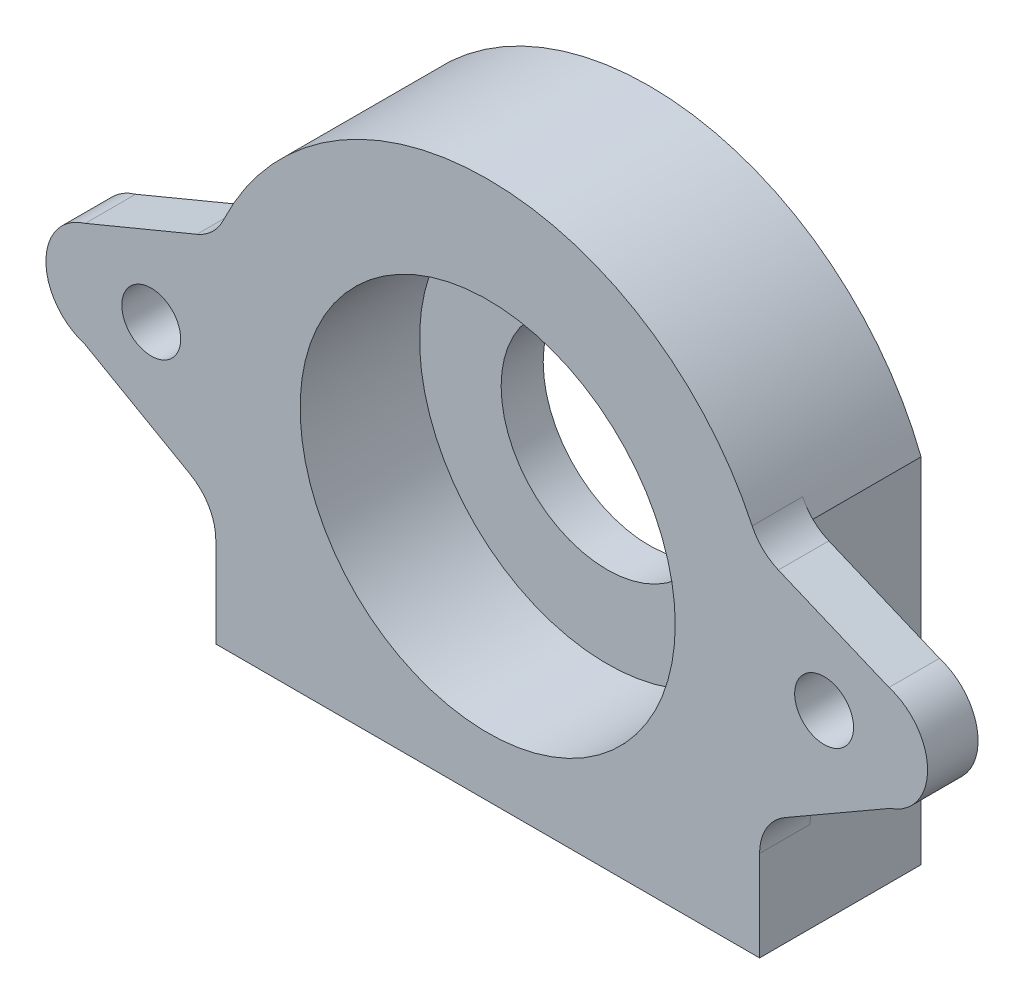
ISO-10303-21;
HEADER;
FILE_DESCRIPTION(('STEP AP214'),'2;1');
FILE_NAME('part.step','',(''),(''),'','','');
FILE_SCHEMA(('AUTOMOTIVE_DESIGN { 1 0 10303 214 1 1 1 1 }'));
ENDSEC;
DATA;
#1=APPLICATION_CONTEXT('core data for automotive mechanical design processes');
#2=APPLICATION_PROTOCOL_DEFINITION('international standard','automotive_design',2000,#1);
#3=PRODUCT_CONTEXT('',#1,'mechanical');
#4=PRODUCT('Part','Part','',(#3));
#5=PRODUCT_RELATED_PRODUCT_CATEGORY('part','',(#4));
#6=PRODUCT_DEFINITION_FORMATION('','',#4);
#7=PRODUCT_DEFINITION_CONTEXT('part definition',#1,'design');
#8=PRODUCT_DEFINITION('design','',#6,#7);
#9=PRODUCT_DEFINITION_SHAPE('','',#8);
#10=(LENGTH_UNIT() NAMED_UNIT(*) SI_UNIT(.MILLI.,.METRE.));
#11=(NAMED_UNIT(*) PLANE_ANGLE_UNIT() SI_UNIT($,.RADIAN.));
#12=(NAMED_UNIT(*) SI_UNIT($,.STERADIAN.) SOLID_ANGLE_UNIT());
#13=UNCERTAINTY_MEASURE_WITH_UNIT(LENGTH_MEASURE(1.E-05),#10,'distance_accuracy_value','');
#14=(GEOMETRIC_REPRESENTATION_CONTEXT(3) GLOBAL_UNCERTAINTY_ASSIGNED_CONTEXT((#13)) GLOBAL_UNIT_ASSIGNED_CONTEXT((#10,
#11,#12)) REPRESENTATION_CONTEXT('',''));
#15=CARTESIAN_POINT('',(0.,0.,0.));
#16=DIRECTION('',(0.,0.,1.));
#17=DIRECTION('',(1.,0.,0.));
#18=AXIS2_PLACEMENT_3D('',#15,#16,#17);
#19=CARTESIAN_POINT('',(0.,0.,2.5));
#20=DIRECTION('',(0.,0.,1.));
#21=DIRECTION('',(1.,0.,0.));
#22=AXIS2_PLACEMENT_3D('',#19,#20,#21);
#23=PLANE('',#22);
#24=CARTESIAN_POINT('',(0.,0.,2.5));
#25=DIRECTION('',(0.,0.,1.));
#26=DIRECTION('',(1.,0.,0.));
#27=AXIS2_PLACEMENT_3D('',#24,#25,#26);
#28=CIRCLE('',#27,6.30000000000002);
#29=CARTESIAN_POINT('',(6.29999999999994,0.,2.5));
#30=VERTEX_POINT('',#29);
#31=EDGE_CURVE('E196',#30,#30,#28,.F.);
#32=ORIENTED_EDGE('',*,*,#31,.T.);
#33=EDGE_LOOP('',(#32));
#34=FACE_BOUND('',#33,.T.);
#35=CARTESIAN_POINT('',(0.,0.,2.5));
#36=DIRECTION('',(0.,0.,1.));
#37=DIRECTION('',(1.,0.,0.));
#38=AXIS2_PLACEMENT_3D('',#35,#36,#37);
#39=CIRCLE('',#38,11.15);
#40=CARTESIAN_POINT('',(11.15,0.,2.5));
#41=VERTEX_POINT('',#40);
#42=EDGE_CURVE('E11',#41,#41,#39,.F.);
#43=ORIENTED_EDGE('',*,*,#42,.F.);
#44=EDGE_LOOP('',(#43));
#45=FACE_BOUND('',#44,.T.);
#46=ADVANCED_FACE('F41',(#34,#45),#23,.T.);
#47=CARTESIAN_POINT('',(-16.1638504935599,6.34296785302776,2.5));
#48=DIRECTION('',(1.,0.,0.));
#49=DIRECTION('',(0.,0.,-1.));
#50=AXIS2_PLACEMENT_3D('',#47,#48,#49);
#51=PLANE('',#50);
#52=DIRECTION('',(0.,-1.,0.));
#53=VECTOR('',#52,1.);
#54=CARTESIAN_POINT('',(-16.1638504935599,6.34296785302776,0.));
#55=LINE('',#54,#53);
#56=CARTESIAN_POINT('',(-16.1638504935599,6.34296785302776,0.));
#57=VERTEX_POINT('',#56);
#58=CARTESIAN_POINT('',(-16.1638504935599,-14.6559029883289,0.));
#59=VERTEX_POINT('',#58);
#60=EDGE_CURVE('E168',#57,#59,#55,.T.);
#61=ORIENTED_EDGE('',*,*,#60,.T.);
#62=DIRECTION('',(0.,0.,-1.));
#63=VECTOR('',#62,1.);
#64=CARTESIAN_POINT('',(-16.1638504935599,-14.6559029883289,9.6));
#65=LINE('',#64,#63);
#66=CARTESIAN_POINT('',(-16.1638504935599,-14.6559029883289,9.6));
#67=VERTEX_POINT('',#66);
#68=EDGE_CURVE('E184',#67,#59,#65,.T.);
#69=ORIENTED_EDGE('',*,*,#68,.F.);
#70=DIRECTION('',(0.,-1.,0.));
#71=VECTOR('',#70,1.);
#72=CARTESIAN_POINT('',(-16.1638504935599,6.34296785302776,9.6));
#73=LINE('',#72,#71);
#74=CARTESIAN_POINT('',(-16.1638504935599,-9.28714517687184,9.6));
#75=VERTEX_POINT('',#74);
#76=EDGE_CURVE('E288',#75,#67,#73,.T.);
#77=ORIENTED_EDGE('',*,*,#76,.F.);
#78=DIRECTION('',(0.,0.,1.));
#79=VECTOR('',#78,1.);
#80=CARTESIAN_POINT('',(-16.1638504935599,-9.28714517687184,2.5));
#81=LINE('',#80,#79);
#82=CARTESIAN_POINT('',(-16.1638504935599,-9.28714517687184,6.6));
#83=VERTEX_POINT('',#82);
#84=EDGE_CURVE('E323',#75,#83,#81,.F.);
#85=ORIENTED_EDGE('',*,*,#84,.T.);
#86=DIRECTION('',(0.,1.,0.));
#87=VECTOR('',#86,1.);
#88=CARTESIAN_POINT('',(-16.1638504935599,-7.54270165831346,6.6));
#89=LINE('',#88,#87);
#90=CARTESIAN_POINT('',(-16.1638504935599,6.34296785302776,6.6));
#91=VERTEX_POINT('',#90);
#92=EDGE_CURVE('E217',#83,#91,#89,.T.);
#93=ORIENTED_EDGE('',*,*,#92,.T.);
#94=DIRECTION('',(0.,0.,-1.));
#95=VECTOR('',#94,1.);
#96=CARTESIAN_POINT('',(-16.1638504935599,6.34296785302776,2.5));
#97=LINE('',#96,#95);
#98=EDGE_CURVE('E300',#91,#57,#97,.T.);
#99=ORIENTED_EDGE('',*,*,#98,.T.);
#100=EDGE_LOOP('',(#61,#69,#77,#85,#93,#99));
#101=FACE_BOUND('',#100,.T.);
#102=ADVANCED_FACE('F400',(#101),#51,.F.);
#103=CARTESIAN_POINT('',(16.1638504935599,-14.4243961967111,2.5));
#104=DIRECTION('',(-1.,0.,0.));
#105=DIRECTION('',(0.,0.,1.));
#106=AXIS2_PLACEMENT_3D('',#103,#104,#105);
#107=PLANE('',#106);
#108=DIRECTION('',(0.,1.,0.));
#109=VECTOR('',#108,1.);
#110=CARTESIAN_POINT('',(16.1638504935599,-14.4243961967111,9.6));
#111=LINE('',#110,#109);
#112=CARTESIAN_POINT('',(16.1638504935599,-14.6559029883289,9.6));
#113=VERTEX_POINT('',#112);
#114=CARTESIAN_POINT('',(16.1638504935599,-9.27696063855389,9.6));
#115=VERTEX_POINT('',#114);
#116=EDGE_CURVE('E174',#113,#115,#111,.T.);
#117=ORIENTED_EDGE('',*,*,#116,.F.);
#118=DIRECTION('',(0.,0.,1.));
#119=VECTOR('',#118,1.);
#120=CARTESIAN_POINT('',(16.1638504935599,-14.6559029883289,0.));
#121=LINE('',#120,#119);
#122=CARTESIAN_POINT('',(16.1638504935599,-14.6559029883289,0.));
#123=VERTEX_POINT('',#122);
#124=EDGE_CURVE('E171',#123,#113,#121,.T.);
#125=ORIENTED_EDGE('',*,*,#124,.F.);
#126=DIRECTION('',(0.,1.,0.));
#127=VECTOR('',#126,1.);
#128=CARTESIAN_POINT('',(16.1638504935599,-14.4243961967111,0.));
#129=LINE('',#128,#127);
#130=CARTESIAN_POINT('',(16.1638504935599,6.34296785302777,0.));
#131=VERTEX_POINT('',#130);
#132=EDGE_CURVE('E156',#123,#131,#129,.T.);
#133=ORIENTED_EDGE('',*,*,#132,.T.);
#134=DIRECTION('',(0.,0.,-1.));
#135=VECTOR('',#134,1.);
#136=CARTESIAN_POINT('',(16.1638504935599,6.34296785302777,2.5));
#137=LINE('',#136,#135);
#138=CARTESIAN_POINT('',(16.1638504935599,6.34296785302777,6.6));
#139=VERTEX_POINT('',#138);
#140=EDGE_CURVE('E297',#139,#131,#137,.T.);
#141=ORIENTED_EDGE('',*,*,#140,.F.);
#142=DIRECTION('',(0.,-1.,0.));
#143=VECTOR('',#142,1.);
#144=CARTESIAN_POINT('',(16.1638504935599,-7.5427016583135,6.6));
#145=LINE('',#144,#143);
#146=CARTESIAN_POINT('',(16.1638504935599,-9.27696063855388,6.6));
#147=VERTEX_POINT('',#146);
#148=EDGE_CURVE('E257',#139,#147,#145,.T.);
#149=ORIENTED_EDGE('',*,*,#148,.T.);
#150=DIRECTION('',(0.,0.,1.));
#151=VECTOR('',#150,1.);
#152=CARTESIAN_POINT('',(16.1638504935599,-9.27696063855388,2.5));
#153=LINE('',#152,#151);
#154=EDGE_CURVE('E327',#147,#115,#153,.T.);
#155=ORIENTED_EDGE('',*,*,#154,.T.);
#156=EDGE_LOOP('',(#117,#125,#133,#141,#149,#155));
#157=FACE_BOUND('',#156,.T.);
#158=ADVANCED_FACE('F172',(#157),#107,.F.);
#159=CARTESIAN_POINT('',(0.,0.,0.));
#160=DIRECTION('',(0.,0.,1.));
#161=DIRECTION('',(1.,0.,0.));
#162=AXIS2_PLACEMENT_3D('',#159,#160,#161);
#163=PLANE('',#162);
#164=CARTESIAN_POINT('',(0.,0.,0.));
#165=DIRECTION('',(0.,0.,-1.));
#166=DIRECTION('',(-1.,0.,0.));
#167=AXIS2_PLACEMENT_3D('',#164,#165,#166);
#168=CIRCLE('',#167,6.30000000000002);
#169=CARTESIAN_POINT('',(-6.30000000000009,0.,0.));
#170=VERTEX_POINT('',#169);
#171=EDGE_CURVE('E197',#170,#170,#168,.T.);
#172=ORIENTED_EDGE('',*,*,#171,.F.);
#173=EDGE_LOOP('',(#172));
#174=FACE_BOUND('',#173,.T.);
#175=ORIENTED_EDGE('',*,*,#132,.F.);
#176=DIRECTION('',(1.,0.,0.));
#177=VECTOR('',#176,1.);
#178=CARTESIAN_POINT('',(-16.1638504935599,-14.6559029883289,0.));
#179=LINE('',#178,#177);
#180=EDGE_CURVE('E161',#59,#123,#179,.T.);
#181=ORIENTED_EDGE('',*,*,#180,.F.);
#182=ORIENTED_EDGE('',*,*,#60,.F.);
#183=CARTESIAN_POINT('',(0.,0.,0.));
#184=DIRECTION('',(0.,0.,1.));
#185=DIRECTION('',(1.,0.,0.));
#186=AXIS2_PLACEMENT_3D('',#183,#184,#185);
#187=CIRCLE('',#186,17.3638504935599);
#188=EDGE_CURVE('E163',#131,#57,#187,.T.);
#189=ORIENTED_EDGE('',*,*,#188,.F.);
#190=EDGE_LOOP('',(#175,#181,#182,#189));
#191=FACE_BOUND('',#190,.T.);
#192=ADVANCED_FACE('F158',(#174,#191),#163,.F.);
#193=CARTESIAN_POINT('',(0.,0.,9.6));
#194=DIRECTION('',(0.,0.,1.));
#195=DIRECTION('',(1.,0.,0.));
#196=AXIS2_PLACEMENT_3D('',#193,#194,#195);
#197=PLANE('',#196);
#198=ORIENTED_EDGE('',*,*,#76,.T.);
#199=DIRECTION('',(-1.,0.,0.));
#200=VECTOR('',#199,1.);
#201=CARTESIAN_POINT('',(16.1638504935599,-14.6559029883289,9.6));
#202=LINE('',#201,#200);
#203=EDGE_CURVE('E179',#113,#67,#202,.T.);
#204=ORIENTED_EDGE('',*,*,#203,.F.);
#205=ORIENTED_EDGE('',*,*,#116,.T.);
#206=CARTESIAN_POINT('',(19.1638504935599,-9.27696063855388,9.6));
#207=DIRECTION('',(0.,0.,1.));
#208=DIRECTION('',(1.,0.,0.));
#209=AXIS2_PLACEMENT_3D('',#206,#207,#208);
#210=CIRCLE('',#209,3.);
#211=CARTESIAN_POINT('',(17.6667189928393,-6.67723040840499,9.6));
#212=VERTEX_POINT('',#211);
#213=EDGE_CURVE('E348',#115,#212,#210,.F.);
#214=ORIENTED_EDGE('',*,*,#213,.T.);
#215=DIRECTION('',(0.866576743382963,0.499043833573543,0.));
#216=VECTOR('',#215,1.);
#217=CARTESIAN_POINT('',(16.1638504935599,-7.5427016583135,9.6));
#218=LINE('',#217,#216);
#219=CARTESIAN_POINT('',(23.925870501949,-3.07271299217504,9.6));
#220=VERTEX_POINT('',#219);
#221=EDGE_CURVE('E272',#212,#220,#218,.T.);
#222=ORIENTED_EDGE('',*,*,#221,.T.);
#223=CARTESIAN_POINT('',(22.9022278104594,0.0118705518645778,9.6));
#224=DIRECTION('',(0.,0.,1.));
#225=DIRECTION('',(1.,0.,0.));
#226=AXIS2_PLACEMENT_3D('',#223,#224,#225);
#227=CIRCLE('',#226,3.25000000000001);
#228=CARTESIAN_POINT('',(23.8591950565423,3.11778646990301,9.6));
#229=VERTEX_POINT('',#228);
#230=EDGE_CURVE('E258',#220,#229,#227,.T.);
#231=ORIENTED_EDGE('',*,*,#230,.T.);
#232=DIRECTION('',(-0.922275512084958,0.38653315486311,0.));
#233=VECTOR('',#232,1.);
#234=CARTESIAN_POINT('',(23.8591950565423,3.11778646990301,9.6));
#235=LINE('',#234,#233);
#236=CARTESIAN_POINT('',(17.2794362117091,5.87541682136088,9.6));
#237=VERTEX_POINT('',#236);
#238=EDGE_CURVE('E250',#229,#237,#235,.T.);
#239=ORIENTED_EDGE('',*,*,#238,.T.);
#240=CARTESIAN_POINT('',(18.4390356762984,8.64224335761576,9.6));
#241=DIRECTION('',(0.,0.,1.));
#242=DIRECTION('',(1.,0.,0.));
#243=AXIS2_PLACEMENT_3D('',#240,#241,#242);
#244=CIRCLE('',#243,3.);
#245=CARTESIAN_POINT('',(15.7225991631552,7.3690691079302,9.6));
#246=VERTEX_POINT('',#245);
#247=EDGE_CURVE('E50',#237,#246,#244,.F.);
#248=ORIENTED_EDGE('',*,*,#247,.T.);
#249=CARTESIAN_POINT('',(0.,0.,9.6));
#250=DIRECTION('',(0.,0.,1.));
#251=DIRECTION('',(1.,0.,0.));
#252=AXIS2_PLACEMENT_3D('',#249,#250,#251);
#253=CIRCLE('',#252,17.3638504935599);
#254=CARTESIAN_POINT('',(-15.7204816007306,7.3735854374782,9.6));
#255=VERTEX_POINT('',#254);
#256=EDGE_CURVE('E281',#246,#255,#253,.T.);
#257=ORIENTED_EDGE('',*,*,#256,.T.);
#258=CARTESIAN_POINT('',(-18.4365522568148,8.64753998578755,9.6));
#259=DIRECTION('',(0.,0.,1.));
#260=DIRECTION('',(1.,0.,0.));
#261=AXIS2_PLACEMENT_3D('',#258,#259,#260);
#262=CIRCLE('',#261,3.);
#263=CARTESIAN_POINT('',(-17.2859329859879,5.87696688738324,9.6));
#264=VERTEX_POINT('',#263);
#265=EDGE_CURVE('E339',#255,#264,#262,.F.);
#266=ORIENTED_EDGE('',*,*,#265,.T.);
#267=DIRECTION('',(-0.923524366134774,-0.383539756942308,0.));
#268=VECTOR('',#267,1.);
#269=CARTESIAN_POINT('',(-16.1638504935599,6.34296785302776,9.6));
#270=LINE('',#269,#268);
#271=CARTESIAN_POINT('',(-23.9297562141706,3.11778646990307,9.6));
#272=VERTEX_POINT('',#271);
#273=EDGE_CURVE('E233',#264,#272,#270,.T.);
#274=ORIENTED_EDGE('',*,*,#273,.T.);
#275=CARTESIAN_POINT('',(-23.012201023411,0.,9.6));
#276=DIRECTION('',(0.,0.,1.));
#277=DIRECTION('',(1.,0.,0.));
#278=AXIS2_PLACEMENT_3D('',#275,#276,#277);
#279=CIRCLE('',#278,3.25);
#280=CARTESIAN_POINT('',(-23.9484846038936,-3.11221353009693,9.6));
#281=VERTEX_POINT('',#280);
#282=EDGE_CURVE('E218',#272,#281,#279,.T.);
#283=ORIENTED_EDGE('',*,*,#282,.T.);
#284=DIRECTION('',(0.869101454063499,-0.494633867163089,0.));
#285=VECTOR('',#284,1.);
#286=CARTESIAN_POINT('',(-23.9484846038936,-3.11221353009693,9.6));
#287=LINE('',#286,#285);
#288=CARTESIAN_POINT('',(-17.6799488920706,-6.67984081468134,9.6));
#289=VERTEX_POINT('',#288);
#290=EDGE_CURVE('E209',#281,#289,#287,.T.);
#291=ORIENTED_EDGE('',*,*,#290,.T.);
#292=CARTESIAN_POINT('',(-19.1638504935599,-9.28714517687184,9.6));
#293=DIRECTION('',(0.,0.,1.));
#294=DIRECTION('',(1.,0.,0.));
#295=AXIS2_PLACEMENT_3D('',#292,#293,#294);
#296=CIRCLE('',#295,3.);
#297=EDGE_CURVE('E342',#289,#75,#296,.F.);
#298=ORIENTED_EDGE('',*,*,#297,.T.);
#299=EDGE_LOOP('',(#198,#204,#205,#214,#222,#231,#239,#248,#257,#266,#274,#283,#291,#298));
#300=FACE_BOUND('',#299,.T.);
#301=CARTESIAN_POINT('',(20.,0.,9.6));
#302=DIRECTION('',(0.,0.,1.));
#303=DIRECTION('',(1.,0.,0.));
#304=AXIS2_PLACEMENT_3D('',#301,#302,#303);
#305=CIRCLE('',#304,1.75);
#306=CARTESIAN_POINT('',(21.75,0.,9.6));
#307=VERTEX_POINT('',#306);
#308=EDGE_CURVE('E242',#307,#307,#305,.T.);
#309=ORIENTED_EDGE('',*,*,#308,.F.);
#310=EDGE_LOOP('',(#309));
#311=FACE_BOUND('',#310,.T.);
#312=CARTESIAN_POINT('',(-20.,0.,9.6));
#313=DIRECTION('',(0.,0.,1.));
#314=DIRECTION('',(1.,0.,0.));
#315=AXIS2_PLACEMENT_3D('',#312,#313,#314);
#316=CIRCLE('',#315,1.75);
#317=CARTESIAN_POINT('',(-18.25,0.,9.6));
#318=VERTEX_POINT('',#317);
#319=EDGE_CURVE('E201',#318,#318,#316,.T.);
#320=ORIENTED_EDGE('',*,*,#319,.F.);
#321=EDGE_LOOP('',(#320));
#322=FACE_BOUND('',#321,.T.);
#323=CARTESIAN_POINT('',(0.,0.,9.6));
#324=DIRECTION('',(0.,0.,1.));
#325=DIRECTION('',(1.,0.,0.));
#326=AXIS2_PLACEMENT_3D('',#323,#324,#325);
#327=CIRCLE('',#326,11.15);
#328=CARTESIAN_POINT('',(11.15,0.,9.6));
#329=VERTEX_POINT('',#328);
#330=EDGE_CURVE('E192',#329,#329,#327,.T.);
#331=ORIENTED_EDGE('',*,*,#330,.F.);
#332=EDGE_LOOP('',(#331));
#333=FACE_BOUND('',#332,.T.);
#334=ADVANCED_FACE('F360',(#300,#311,#322,#333),#197,.T.);
#335=CARTESIAN_POINT('',(0.,0.,2.5));
#336=DIRECTION('',(0.,0.,-1.));
#337=DIRECTION('',(-1.,0.,0.));
#338=AXIS2_PLACEMENT_3D('',#335,#336,#337);
#339=CYLINDRICAL_SURFACE('',#338,17.3638504935599);
#340=ORIENTED_EDGE('',*,*,#98,.F.);
#341=CARTESIAN_POINT('',(0.,0.,6.6));
#342=DIRECTION('',(0.,0.,1.));
#343=DIRECTION('',(1.,0.,0.));
#344=AXIS2_PLACEMENT_3D('',#341,#342,#343);
#345=CIRCLE('',#344,17.3638504935599);
#346=CARTESIAN_POINT('',(-15.7204816007306,7.37358543747819,6.6));
#347=VERTEX_POINT('',#346);
#348=EDGE_CURVE('E57',#91,#347,#345,.F.);
#349=ORIENTED_EDGE('',*,*,#348,.T.);
#350=DIRECTION('',(0.,0.,-1.));
#351=VECTOR('',#350,1.);
#352=CARTESIAN_POINT('',(-15.7204816007306,7.37358543747819,2.5));
#353=LINE('',#352,#351);
#354=EDGE_CURVE('E314',#347,#255,#353,.F.);
#355=ORIENTED_EDGE('',*,*,#354,.T.);
#356=ORIENTED_EDGE('',*,*,#256,.F.);
#357=DIRECTION('',(0.,0.,-1.));
#358=VECTOR('',#357,1.);
#359=CARTESIAN_POINT('',(15.7225991631552,7.36906910793019,2.5));
#360=LINE('',#359,#358);
#361=CARTESIAN_POINT('',(15.7225991631552,7.36906910793019,6.6));
#362=VERTEX_POINT('',#361);
#363=EDGE_CURVE('E310',#246,#362,#360,.T.);
#364=ORIENTED_EDGE('',*,*,#363,.T.);
#365=CARTESIAN_POINT('',(0.,0.,6.6));
#366=DIRECTION('',(0.,0.,1.));
#367=DIRECTION('',(1.,0.,0.));
#368=AXIS2_PLACEMENT_3D('',#365,#366,#367);
#369=CIRCLE('',#368,17.3638504935599);
#370=EDGE_CURVE('E307',#362,#139,#369,.F.);
#371=ORIENTED_EDGE('',*,*,#370,.T.);
#372=ORIENTED_EDGE('',*,*,#140,.T.);
#373=ORIENTED_EDGE('',*,*,#188,.T.);
#374=EDGE_LOOP('',(#340,#349,#355,#356,#364,#371,#372,#373));
#375=FACE_BOUND('',#374,.T.);
#376=ADVANCED_FACE('F368',(#375),#339,.T.);
#377=CARTESIAN_POINT('',(23.8591950565423,3.11778646990301,6.6));
#378=DIRECTION('',(0.38653315486311,0.922275512084958,0.));
#379=DIRECTION('',(-0.922275512084958,0.38653315486311,0.));
#380=AXIS2_PLACEMENT_3D('',#377,#378,#379);
#381=PLANE('',#380);
#382=DIRECTION('',(-0.922275512084958,0.38653315486311,0.));
#383=VECTOR('',#382,1.);
#384=CARTESIAN_POINT('',(23.8591950565423,3.11778646990301,6.6));
#385=LINE('',#384,#383);
#386=CARTESIAN_POINT('',(23.8591950565423,3.11778646990301,6.6));
#387=VERTEX_POINT('',#386);
#388=CARTESIAN_POINT('',(17.2794362117091,5.87541682136088,6.6));
#389=VERTEX_POINT('',#388);
#390=EDGE_CURVE('E254',#387,#389,#385,.T.);
#391=ORIENTED_EDGE('',*,*,#390,.T.);
#392=DIRECTION('',(0.,0.,-1.));
#393=VECTOR('',#392,1.);
#394=CARTESIAN_POINT('',(17.2794362117091,5.87541682136088,6.6));
#395=LINE('',#394,#393);
#396=EDGE_CURVE('E333',#389,#237,#395,.F.);
#397=ORIENTED_EDGE('',*,*,#396,.T.);
#398=ORIENTED_EDGE('',*,*,#238,.F.);
#399=DIRECTION('',(0.,0.,1.));
#400=VECTOR('',#399,1.);
#401=CARTESIAN_POINT('',(23.8591950565423,3.11778646990301,6.6));
#402=LINE('',#401,#400);
#403=EDGE_CURVE('E278',#387,#229,#402,.T.);
#404=ORIENTED_EDGE('',*,*,#403,.F.);
#405=EDGE_LOOP('',(#391,#397,#398,#404));
#406=FACE_BOUND('',#405,.T.);
#407=ADVANCED_FACE('F388',(#406),#381,.T.);
#408=CARTESIAN_POINT('',(22.9022278104594,0.0118705518645778,6.6));
#409=DIRECTION('',(0.,0.,1.));
#410=DIRECTION('',(1.,0.,0.));
#411=AXIS2_PLACEMENT_3D('',#408,#409,#410);
#412=CYLINDRICAL_SURFACE('',#411,3.25000000000001);
#413=ORIENTED_EDGE('',*,*,#230,.F.);
#414=DIRECTION('',(0.,0.,1.));
#415=VECTOR('',#414,1.);
#416=CARTESIAN_POINT('',(23.925870501949,-3.07271299217504,6.6));
#417=LINE('',#416,#415);
#418=CARTESIAN_POINT('',(23.925870501949,-3.07271299217504,6.6));
#419=VERTEX_POINT('',#418);
#420=EDGE_CURVE('E268',#419,#220,#417,.T.);
#421=ORIENTED_EDGE('',*,*,#420,.F.);
#422=CARTESIAN_POINT('',(22.9022278104594,0.0118705518645778,6.6));
#423=DIRECTION('',(0.,0.,1.));
#424=DIRECTION('',(1.,0.,0.));
#425=AXIS2_PLACEMENT_3D('',#422,#423,#424);
#426=CIRCLE('',#425,3.25000000000001);
#427=EDGE_CURVE('E264',#419,#387,#426,.T.);
#428=ORIENTED_EDGE('',*,*,#427,.T.);
#429=ORIENTED_EDGE('',*,*,#403,.T.);
#430=EDGE_LOOP('',(#413,#421,#428,#429));
#431=FACE_BOUND('',#430,.T.);
#432=ADVANCED_FACE('F386',(#431),#412,.T.);
#433=CARTESIAN_POINT('',(16.1638504935599,-7.5427016583135,6.6));
#434=DIRECTION('',(0.499043833573543,-0.866576743382963,0.));
#435=DIRECTION('',(0.866576743382963,0.499043833573543,0.));
#436=AXIS2_PLACEMENT_3D('',#433,#434,#435);
#437=PLANE('',#436);
#438=ORIENTED_EDGE('',*,*,#221,.F.);
#439=DIRECTION('',(0.,0.,1.));
#440=VECTOR('',#439,1.);
#441=CARTESIAN_POINT('',(17.6667189928393,-6.67723040840499,6.6));
#442=LINE('',#441,#440);
#443=CARTESIAN_POINT('',(17.6667189928393,-6.67723040840499,6.6));
#444=VERTEX_POINT('',#443);
#445=EDGE_CURVE('E330',#212,#444,#442,.F.);
#446=ORIENTED_EDGE('',*,*,#445,.T.);
#447=DIRECTION('',(0.866576743382963,0.499043833573543,0.));
#448=VECTOR('',#447,1.);
#449=CARTESIAN_POINT('',(16.1638504935599,-7.5427016583135,6.6));
#450=LINE('',#449,#448);
#451=EDGE_CURVE('E261',#444,#419,#450,.T.);
#452=ORIENTED_EDGE('',*,*,#451,.T.);
#453=ORIENTED_EDGE('',*,*,#420,.T.);
#454=EDGE_LOOP('',(#438,#446,#452,#453));
#455=FACE_BOUND('',#454,.T.);
#456=ADVANCED_FACE('F382',(#455),#437,.T.);
#457=CARTESIAN_POINT('',(22.9022278104594,0.0118705518645778,6.6));
#458=DIRECTION('',(0.,0.,1.));
#459=DIRECTION('',(1.,0.,0.));
#460=AXIS2_PLACEMENT_3D('',#457,#458,#459);
#461=PLANE('',#460);
#462=CARTESIAN_POINT('',(20.,0.,6.6));
#463=DIRECTION('',(0.,0.,1.));
#464=DIRECTION('',(1.,0.,0.));
#465=AXIS2_PLACEMENT_3D('',#462,#463,#464);
#466=CIRCLE('',#465,1.75);
#467=CARTESIAN_POINT('',(21.75,0.,6.6));
#468=VERTEX_POINT('',#467);
#469=EDGE_CURVE('E246',#468,#468,#466,.T.);
#470=ORIENTED_EDGE('',*,*,#469,.T.);
#471=EDGE_LOOP('',(#470));
#472=FACE_BOUND('',#471,.T.);
#473=ORIENTED_EDGE('',*,*,#390,.F.);
#474=ORIENTED_EDGE('',*,*,#427,.F.);
#475=ORIENTED_EDGE('',*,*,#451,.F.);
#476=CARTESIAN_POINT('',(19.1638504935599,-9.27696063855388,6.6));
#477=DIRECTION('',(0.,0.,1.));
#478=DIRECTION('',(1.,0.,0.));
#479=AXIS2_PLACEMENT_3D('',#476,#477,#478);
#480=CIRCLE('',#479,3.);
#481=EDGE_CURVE('E351',#444,#147,#480,.T.);
#482=ORIENTED_EDGE('',*,*,#481,.T.);
#483=ORIENTED_EDGE('',*,*,#148,.F.);
#484=ORIENTED_EDGE('',*,*,#370,.F.);
#485=CARTESIAN_POINT('',(18.4390356762984,8.64224335761576,6.6));
#486=DIRECTION('',(0.,0.,1.));
#487=DIRECTION('',(1.,0.,0.));
#488=AXIS2_PLACEMENT_3D('',#485,#486,#487);
#489=CIRCLE('',#488,3.);
#490=EDGE_CURVE('E65',#362,#389,#489,.T.);
#491=ORIENTED_EDGE('',*,*,#490,.T.);
#492=EDGE_LOOP('',(#473,#474,#475,#482,#483,#484,#491));
#493=FACE_BOUND('',#492,.T.);
#494=ADVANCED_FACE('F371',(#472,#493),#461,.F.);
#495=CARTESIAN_POINT('',(20.,0.,6.6));
#496=DIRECTION('',(0.,0.,1.));
#497=DIRECTION('',(1.,0.,0.));
#498=AXIS2_PLACEMENT_3D('',#495,#496,#497);
#499=CYLINDRICAL_SURFACE('',#498,1.75);
#500=ORIENTED_EDGE('',*,*,#469,.F.);
#501=EDGE_LOOP('',(#500));
#502=FACE_BOUND('',#501,.T.);
#503=ORIENTED_EDGE('',*,*,#308,.T.);
#504=EDGE_LOOP('',(#503));
#505=FACE_BOUND('',#504,.T.);
#506=ADVANCED_FACE('F461',(#502,#505),#499,.F.);
#507=CARTESIAN_POINT('',(-23.9484846038936,-3.11221353009693,6.6));
#508=DIRECTION('',(-0.494633867163089,-0.869101454063498,0.));
#509=DIRECTION('',(0.869101454063499,-0.494633867163089,0.));
#510=AXIS2_PLACEMENT_3D('',#507,#508,#509);
#511=PLANE('',#510);
#512=DIRECTION('',(0.869101454063499,-0.494633867163089,0.));
#513=VECTOR('',#512,1.);
#514=CARTESIAN_POINT('',(-23.9484846038936,-3.11221353009693,6.6));
#515=LINE('',#514,#513);
#516=CARTESIAN_POINT('',(-23.9484846038936,-3.11221353009693,6.6));
#517=VERTEX_POINT('',#516);
#518=CARTESIAN_POINT('',(-17.6799488920706,-6.67984081468134,6.6));
#519=VERTEX_POINT('',#518);
#520=EDGE_CURVE('E213',#517,#519,#515,.T.);
#521=ORIENTED_EDGE('',*,*,#520,.T.);
#522=DIRECTION('',(0.,0.,1.));
#523=VECTOR('',#522,1.);
#524=CARTESIAN_POINT('',(-17.6799488920706,-6.67984081468134,6.6));
#525=LINE('',#524,#523);
#526=EDGE_CURVE('E319',#519,#289,#525,.T.);
#527=ORIENTED_EDGE('',*,*,#526,.T.);
#528=ORIENTED_EDGE('',*,*,#290,.F.);
#529=DIRECTION('',(0.,0.,1.));
#530=VECTOR('',#529,1.);
#531=CARTESIAN_POINT('',(-23.9484846038936,-3.11221353009693,6.6));
#532=LINE('',#531,#530);
#533=EDGE_CURVE('E239',#517,#281,#532,.T.);
#534=ORIENTED_EDGE('',*,*,#533,.F.);
#535=EDGE_LOOP('',(#521,#527,#528,#534));
#536=FACE_BOUND('',#535,.T.);
#537=ADVANCED_FACE('F454',(#536),#511,.T.);
#538=CARTESIAN_POINT('',(-23.012201023411,0.,6.6));
#539=DIRECTION('',(0.,0.,1.));
#540=DIRECTION('',(1.,0.,0.));
#541=AXIS2_PLACEMENT_3D('',#538,#539,#540);
#542=CYLINDRICAL_SURFACE('',#541,3.25);
#543=ORIENTED_EDGE('',*,*,#282,.F.);
#544=DIRECTION('',(0.,0.,1.));
#545=VECTOR('',#544,1.);
#546=CARTESIAN_POINT('',(-23.9297562141706,3.11778646990307,6.6));
#547=LINE('',#546,#545);
#548=CARTESIAN_POINT('',(-23.9297562141706,3.11778646990307,6.6));
#549=VERTEX_POINT('',#548);
#550=EDGE_CURVE('E229',#549,#272,#547,.T.);
#551=ORIENTED_EDGE('',*,*,#550,.F.);
#552=CARTESIAN_POINT('',(-23.012201023411,0.,6.6));
#553=DIRECTION('',(0.,0.,1.));
#554=DIRECTION('',(1.,0.,0.));
#555=AXIS2_PLACEMENT_3D('',#552,#553,#554);
#556=CIRCLE('',#555,3.25);
#557=EDGE_CURVE('E225',#549,#517,#556,.T.);
#558=ORIENTED_EDGE('',*,*,#557,.T.);
#559=ORIENTED_EDGE('',*,*,#533,.T.);
#560=EDGE_LOOP('',(#543,#551,#558,#559));
#561=FACE_BOUND('',#560,.T.);
#562=ADVANCED_FACE('F451',(#561),#542,.T.);
#563=CARTESIAN_POINT('',(-16.1638504935599,6.34296785302776,6.6));
#564=DIRECTION('',(-0.383539756942308,0.923524366134774,0.));
#565=DIRECTION('',(-0.923524366134774,-0.383539756942308,0.));
#566=AXIS2_PLACEMENT_3D('',#563,#564,#565);
#567=PLANE('',#566);
#568=ORIENTED_EDGE('',*,*,#273,.F.);
#569=DIRECTION('',(0.,0.,-1.));
#570=VECTOR('',#569,1.);
#571=CARTESIAN_POINT('',(-17.2859329859879,5.87696688738324,6.6));
#572=LINE('',#571,#570);
#573=CARTESIAN_POINT('',(-17.2859329859879,5.87696688738324,6.6));
#574=VERTEX_POINT('',#573);
#575=EDGE_CURVE('E303',#264,#574,#572,.T.);
#576=ORIENTED_EDGE('',*,*,#575,.T.);
#577=DIRECTION('',(-0.923524366134774,-0.383539756942308,0.));
#578=VECTOR('',#577,1.);
#579=CARTESIAN_POINT('',(-16.1638504935599,6.34296785302776,6.6));
#580=LINE('',#579,#578);
#581=EDGE_CURVE('E222',#574,#549,#580,.T.);
#582=ORIENTED_EDGE('',*,*,#581,.T.);
#583=ORIENTED_EDGE('',*,*,#550,.T.);
#584=EDGE_LOOP('',(#568,#576,#582,#583));
#585=FACE_BOUND('',#584,.T.);
#586=ADVANCED_FACE('F449',(#585),#567,.T.);
#587=CARTESIAN_POINT('',(-23.012201023411,0.,6.6));
#588=DIRECTION('',(0.,0.,1.));
#589=DIRECTION('',(1.,0.,0.));
#590=AXIS2_PLACEMENT_3D('',#587,#588,#589);
#591=PLANE('',#590);
#592=CARTESIAN_POINT('',(-20.,0.,6.6));
#593=DIRECTION('',(0.,0.,1.));
#594=DIRECTION('',(1.,0.,0.));
#595=AXIS2_PLACEMENT_3D('',#592,#593,#594);
#596=CIRCLE('',#595,1.75);
#597=CARTESIAN_POINT('',(-18.25,0.,6.6));
#598=VERTEX_POINT('',#597);
#599=EDGE_CURVE('E205',#598,#598,#596,.T.);
#600=ORIENTED_EDGE('',*,*,#599,.T.);
#601=EDGE_LOOP('',(#600));
#602=FACE_BOUND('',#601,.T.);
#603=ORIENTED_EDGE('',*,*,#520,.F.);
#604=ORIENTED_EDGE('',*,*,#557,.F.);
#605=ORIENTED_EDGE('',*,*,#581,.F.);
#606=CARTESIAN_POINT('',(-18.4365522568148,8.64753998578755,6.6));
#607=DIRECTION('',(0.,0.,1.));
#608=DIRECTION('',(1.,0.,0.));
#609=AXIS2_PLACEMENT_3D('',#606,#607,#608);
#610=CIRCLE('',#609,3.);
#611=EDGE_CURVE('E336',#574,#347,#610,.T.);
#612=ORIENTED_EDGE('',*,*,#611,.T.);
#613=ORIENTED_EDGE('',*,*,#348,.F.);
#614=ORIENTED_EDGE('',*,*,#92,.F.);
#615=CARTESIAN_POINT('',(-19.1638504935599,-9.28714517687184,6.6));
#616=DIRECTION('',(0.,0.,1.));
#617=DIRECTION('',(1.,0.,0.));
#618=AXIS2_PLACEMENT_3D('',#615,#616,#617);
#619=CIRCLE('',#618,3.);
#620=EDGE_CURVE('E345',#83,#519,#619,.T.);
#621=ORIENTED_EDGE('',*,*,#620,.T.);
#622=EDGE_LOOP('',(#603,#604,#605,#612,#613,#614,#621));
#623=FACE_BOUND('',#622,.T.);
#624=ADVANCED_FACE('F445',(#602,#623),#591,.F.);
#625=CARTESIAN_POINT('',(-20.,0.,6.6));
#626=DIRECTION('',(0.,0.,1.));
#627=DIRECTION('',(1.,0.,0.));
#628=AXIS2_PLACEMENT_3D('',#625,#626,#627);
#629=CYLINDRICAL_SURFACE('',#628,1.75);
#630=ORIENTED_EDGE('',*,*,#599,.F.);
#631=EDGE_LOOP('',(#630));
#632=FACE_BOUND('',#631,.T.);
#633=ORIENTED_EDGE('',*,*,#319,.T.);
#634=EDGE_LOOP('',(#633));
#635=FACE_BOUND('',#634,.T.);
#636=ADVANCED_FACE('F419',(#632,#635),#629,.F.);
#637=CARTESIAN_POINT('',(-18.4365522568148,8.64753998578755,2.5));
#638=DIRECTION('',(0.,0.,-1.));
#639=DIRECTION('',(-1.,0.,0.));
#640=AXIS2_PLACEMENT_3D('',#637,#638,#639);
#641=CYLINDRICAL_SURFACE('',#640,3.);
#642=ORIENTED_EDGE('',*,*,#265,.F.);
#643=ORIENTED_EDGE('',*,*,#354,.F.);
#644=ORIENTED_EDGE('',*,*,#611,.F.);
#645=ORIENTED_EDGE('',*,*,#575,.F.);
#646=EDGE_LOOP('',(#642,#643,#644,#645));
#647=FACE_BOUND('',#646,.T.);
#648=ADVANCED_FACE('F415',(#647),#641,.F.);
#649=CARTESIAN_POINT('',(-19.1638504935599,-9.28714517687184,6.6));
#650=DIRECTION('',(0.,0.,1.));
#651=DIRECTION('',(1.,0.,0.));
#652=AXIS2_PLACEMENT_3D('',#649,#650,#651);
#653=CYLINDRICAL_SURFACE('',#652,3.);
#654=ORIENTED_EDGE('',*,*,#620,.F.);
#655=ORIENTED_EDGE('',*,*,#84,.F.);
#656=ORIENTED_EDGE('',*,*,#297,.F.);
#657=ORIENTED_EDGE('',*,*,#526,.F.);
#658=EDGE_LOOP('',(#654,#655,#656,#657));
#659=FACE_BOUND('',#658,.T.);
#660=ADVANCED_FACE('F418',(#659),#653,.F.);
#661=CARTESIAN_POINT('',(19.1638504935599,-9.27696063855388,2.5));
#662=DIRECTION('',(0.,0.,1.));
#663=DIRECTION('',(1.,0.,0.));
#664=AXIS2_PLACEMENT_3D('',#661,#662,#663);
#665=CYLINDRICAL_SURFACE('',#664,3.);
#666=ORIENTED_EDGE('',*,*,#481,.F.);
#667=ORIENTED_EDGE('',*,*,#445,.F.);
#668=ORIENTED_EDGE('',*,*,#213,.F.);
#669=ORIENTED_EDGE('',*,*,#154,.F.);
#670=EDGE_LOOP('',(#666,#667,#668,#669));
#671=FACE_BOUND('',#670,.T.);
#672=ADVANCED_FACE('F379',(#671),#665,.F.);
#673=CARTESIAN_POINT('',(18.4390356762984,8.64224335761576,2.5));
#674=DIRECTION('',(0.,0.,-1.));
#675=DIRECTION('',(-1.,0.,0.));
#676=AXIS2_PLACEMENT_3D('',#673,#674,#675);
#677=CYLINDRICAL_SURFACE('',#676,3.);
#678=ORIENTED_EDGE('',*,*,#247,.F.);
#679=ORIENTED_EDGE('',*,*,#396,.F.);
#680=ORIENTED_EDGE('',*,*,#490,.F.);
#681=ORIENTED_EDGE('',*,*,#363,.F.);
#682=EDGE_LOOP('',(#678,#679,#680,#681));
#683=FACE_BOUND('',#682,.T.);
#684=ADVANCED_FACE('F43',(#683),#677,.F.);
#685=CARTESIAN_POINT('',(0.,0.,9.601));
#686=DIRECTION('',(0.,0.,-1.));
#687=DIRECTION('',(-1.,0.,0.));
#688=AXIS2_PLACEMENT_3D('',#685,#686,#687);
#689=CYLINDRICAL_SURFACE('',#688,6.30000000000002);
#690=ORIENTED_EDGE('',*,*,#31,.F.);
#691=EDGE_LOOP('',(#690));
#692=FACE_BOUND('',#691,.T.);
#693=ORIENTED_EDGE('',*,*,#171,.T.);
#694=EDGE_LOOP('',(#693));
#695=FACE_BOUND('',#694,.T.);
#696=ADVANCED_FACE('F427',(#692,#695),#689,.F.);
#697=CARTESIAN_POINT('',(0.,0.,49.8695330316101));
#698=DIRECTION('',(0.,0.,-1.));
#699=DIRECTION('',(-1.,0.,0.));
#700=AXIS2_PLACEMENT_3D('',#697,#698,#699);
#701=CYLINDRICAL_SURFACE('',#700,11.15);
#702=ORIENTED_EDGE('',*,*,#42,.T.);
#703=EDGE_LOOP('',(#702));
#704=FACE_BOUND('',#703,.T.);
#705=ORIENTED_EDGE('',*,*,#330,.T.);
#706=EDGE_LOOP('',(#705));
#707=FACE_BOUND('',#706,.T.);
#708=ADVANCED_FACE('F431',(#704,#707),#701,.F.);
#709=CARTESIAN_POINT('',(0.,-14.6559029883289,0.));
#710=DIRECTION('',(0.,-1.,0.));
#711=DIRECTION('',(0.,0.,-1.));
#712=AXIS2_PLACEMENT_3D('',#709,#710,#711);
#713=PLANE('',#712);
#714=ORIENTED_EDGE('',*,*,#180,.T.);
#715=ORIENTED_EDGE('',*,*,#124,.T.);
#716=ORIENTED_EDGE('',*,*,#203,.T.);
#717=ORIENTED_EDGE('',*,*,#68,.T.);
#718=EDGE_LOOP('',(#714,#715,#716,#717));
#719=FACE_BOUND('',#718,.T.);
#720=ADVANCED_FACE('F182',(#719),#713,.T.);
#721=CLOSED_SHELL('',(#46,#102,#158,#192,#334,#376,#407,#432,#456,#494,#506,#537,#562,#586,#624,
#636,#648,#660,#672,#684,#696,#708,#720));
#722=MANIFOLD_SOLID_BREP('B2',#721);
#723=ADVANCED_BREP_SHAPE_REPRESENTATION('',(#18,#722),#14);
#724=SHAPE_DEFINITION_REPRESENTATION(#9,#723);
ENDSEC;
END-ISO-10303-21;
